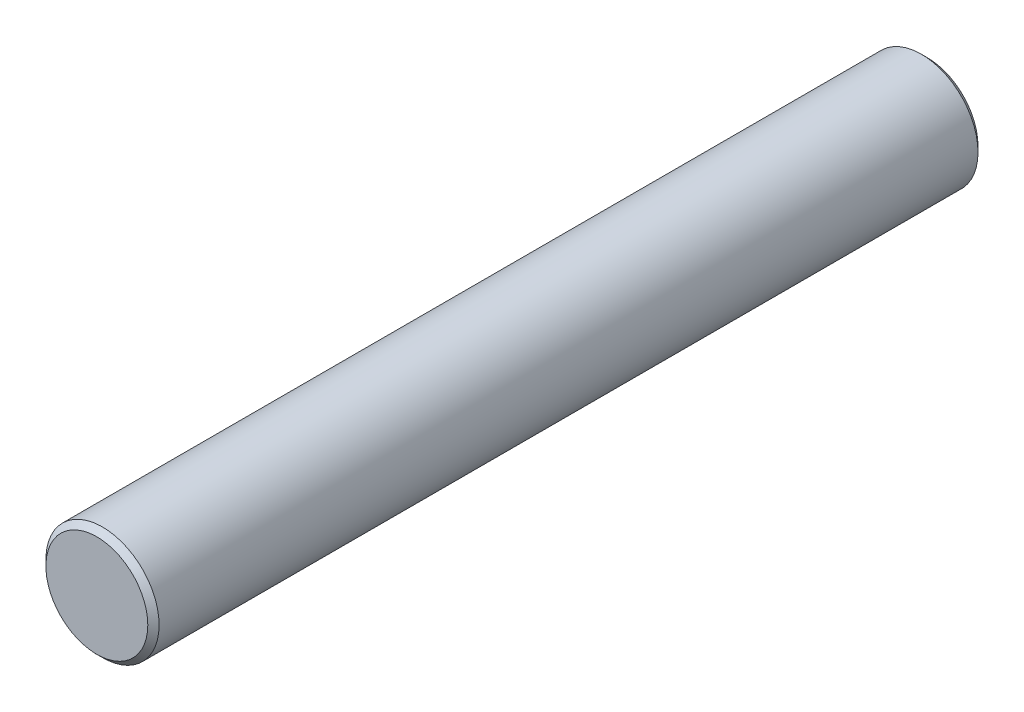
ISO-10303-21;
HEADER;
FILE_DESCRIPTION(('STEP AP214'),'2;1');
FILE_NAME('part.step','',(''),(''),'','','');
FILE_SCHEMA(('AUTOMOTIVE_DESIGN { 1 0 10303 214 1 1 1 1 }'));
ENDSEC;
DATA;
#1=APPLICATION_CONTEXT('core data for automotive mechanical design processes');
#2=APPLICATION_PROTOCOL_DEFINITION('international standard','automotive_design',2000,#1);
#3=PRODUCT_CONTEXT('',#1,'mechanical');
#4=PRODUCT('Part','Part','',(#3));
#5=PRODUCT_RELATED_PRODUCT_CATEGORY('part','',(#4));
#6=PRODUCT_DEFINITION_FORMATION('','',#4);
#7=PRODUCT_DEFINITION_CONTEXT('part definition',#1,'design');
#8=PRODUCT_DEFINITION('design','',#6,#7);
#9=PRODUCT_DEFINITION_SHAPE('','',#8);
#10=(LENGTH_UNIT() NAMED_UNIT(*) SI_UNIT(.MILLI.,.METRE.));
#11=(NAMED_UNIT(*) PLANE_ANGLE_UNIT() SI_UNIT($,.RADIAN.));
#12=(NAMED_UNIT(*) SI_UNIT($,.STERADIAN.) SOLID_ANGLE_UNIT());
#13=UNCERTAINTY_MEASURE_WITH_UNIT(LENGTH_MEASURE(1.E-05),#10,'distance_accuracy_value','');
#14=(GEOMETRIC_REPRESENTATION_CONTEXT(3) GLOBAL_UNCERTAINTY_ASSIGNED_CONTEXT((#13)) GLOBAL_UNIT_ASSIGNED_CONTEXT((#10,
#11,#12)) REPRESENTATION_CONTEXT('',''));
#15=CARTESIAN_POINT('',(0.,0.,0.));
#16=DIRECTION('',(0.,0.,1.));
#17=DIRECTION('',(1.,0.,0.));
#18=AXIS2_PLACEMENT_3D('',#15,#16,#17);
#19=CARTESIAN_POINT('',(0.,0.,11.));
#20=DIRECTION('',(0.,0.,-1.));
#21=DIRECTION('',(-1.,0.,0.));
#22=AXIS2_PLACEMENT_3D('',#19,#20,#21);
#23=CYLINDRICAL_SURFACE('',#22,1.5);
#24=CARTESIAN_POINT('',(0.,0.,-10.85));
#25=DIRECTION('',(0.,0.,1.));
#26=DIRECTION('',(1.,0.,0.));
#27=AXIS2_PLACEMENT_3D('',#24,#25,#26);
#28=CIRCLE('',#27,1.5);
#29=CARTESIAN_POINT('',(1.5,0.,-10.85));
#30=VERTEX_POINT('',#29);
#31=EDGE_CURVE('E53',#30,#30,#28,.T.);
#32=ORIENTED_EDGE('',*,*,#31,.T.);
#33=EDGE_LOOP('',(#32));
#34=FACE_BOUND('',#33,.T.);
#35=CARTESIAN_POINT('',(0.,0.,10.85));
#36=DIRECTION('',(0.,0.,1.));
#37=DIRECTION('',(1.,0.,0.));
#38=AXIS2_PLACEMENT_3D('',#35,#36,#37);
#39=CIRCLE('',#38,1.5);
#40=CARTESIAN_POINT('',(1.5,0.,10.85));
#41=VERTEX_POINT('',#40);
#42=EDGE_CURVE('E58',#41,#41,#39,.F.);
#43=ORIENTED_EDGE('',*,*,#42,.T.);
#44=EDGE_LOOP('',(#43));
#45=FACE_BOUND('',#44,.T.);
#46=ADVANCED_FACE('F39',(#34,#45),#23,.T.);
#47=CARTESIAN_POINT('',(0.,0.,11.));
#48=DIRECTION('',(0.,0.,1.));
#49=DIRECTION('',(1.,0.,0.));
#50=AXIS2_PLACEMENT_3D('',#47,#48,#49);
#51=PLANE('',#50);
#52=CARTESIAN_POINT('',(0.,0.,11.));
#53=DIRECTION('',(0.,0.,1.));
#54=DIRECTION('',(1.,0.,0.));
#55=AXIS2_PLACEMENT_3D('',#52,#53,#54);
#56=CIRCLE('',#55,1.35);
#57=CARTESIAN_POINT('',(1.35,0.,11.));
#58=VERTEX_POINT('',#57);
#59=EDGE_CURVE('E10',#58,#58,#56,.T.);
#60=ORIENTED_EDGE('',*,*,#59,.T.);
#61=EDGE_LOOP('',(#60));
#62=FACE_BOUND('',#61,.T.);
#63=ADVANCED_FACE('F75',(#62),#51,.T.);
#64=CARTESIAN_POINT('',(0.,0.,-11.));
#65=DIRECTION('',(0.,0.,1.));
#66=DIRECTION('',(1.,0.,0.));
#67=AXIS2_PLACEMENT_3D('',#64,#65,#66);
#68=PLANE('',#67);
#69=CARTESIAN_POINT('',(0.,0.,-11.));
#70=DIRECTION('',(0.,0.,1.));
#71=DIRECTION('',(1.,0.,0.));
#72=AXIS2_PLACEMENT_3D('',#69,#70,#71);
#73=CIRCLE('',#72,1.35);
#74=CARTESIAN_POINT('',(1.35,0.,-11.));
#75=VERTEX_POINT('',#74);
#76=EDGE_CURVE('E48',#75,#75,#73,.F.);
#77=ORIENTED_EDGE('',*,*,#76,.T.);
#78=EDGE_LOOP('',(#77));
#79=FACE_BOUND('',#78,.T.);
#80=ADVANCED_FACE('F72',(#79),#68,.F.);
#81=CARTESIAN_POINT('',(0.,0.,-10.85));
#82=DIRECTION('',(0.,0.,1.));
#83=DIRECTION('',(1.,0.,0.));
#84=AXIS2_PLACEMENT_3D('',#81,#82,#83);
#85=CONICAL_SURFACE('',#84,1.5,0.785398163397449);
#86=ORIENTED_EDGE('',*,*,#76,.F.);
#87=EDGE_LOOP('',(#86));
#88=FACE_BOUND('',#87,.T.);
#89=ORIENTED_EDGE('',*,*,#31,.F.);
#90=EDGE_LOOP('',(#89));
#91=FACE_BOUND('',#90,.T.);
#92=ADVANCED_FACE('F68',(#88,#91),#85,.T.);
#93=CARTESIAN_POINT('',(0.,0.,11.));
#94=DIRECTION('',(0.,0.,-1.));
#95=DIRECTION('',(-1.,0.,0.));
#96=AXIS2_PLACEMENT_3D('',#93,#94,#95);
#97=CONICAL_SURFACE('',#96,1.35,0.785398163397449);
#98=ORIENTED_EDGE('',*,*,#42,.F.);
#99=EDGE_LOOP('',(#98));
#100=FACE_BOUND('',#99,.T.);
#101=ORIENTED_EDGE('',*,*,#59,.F.);
#102=EDGE_LOOP('',(#101));
#103=FACE_BOUND('',#102,.T.);
#104=ADVANCED_FACE('F42',(#100,#103),#97,.T.);
#105=CLOSED_SHELL('',(#46,#63,#80,#92,#104));
#106=MANIFOLD_SOLID_BREP('B2',#105);
#107=ADVANCED_BREP_SHAPE_REPRESENTATION('',(#18,#106),#14);
#108=SHAPE_DEFINITION_REPRESENTATION(#9,#107);
ENDSEC;
END-ISO-10303-21;
